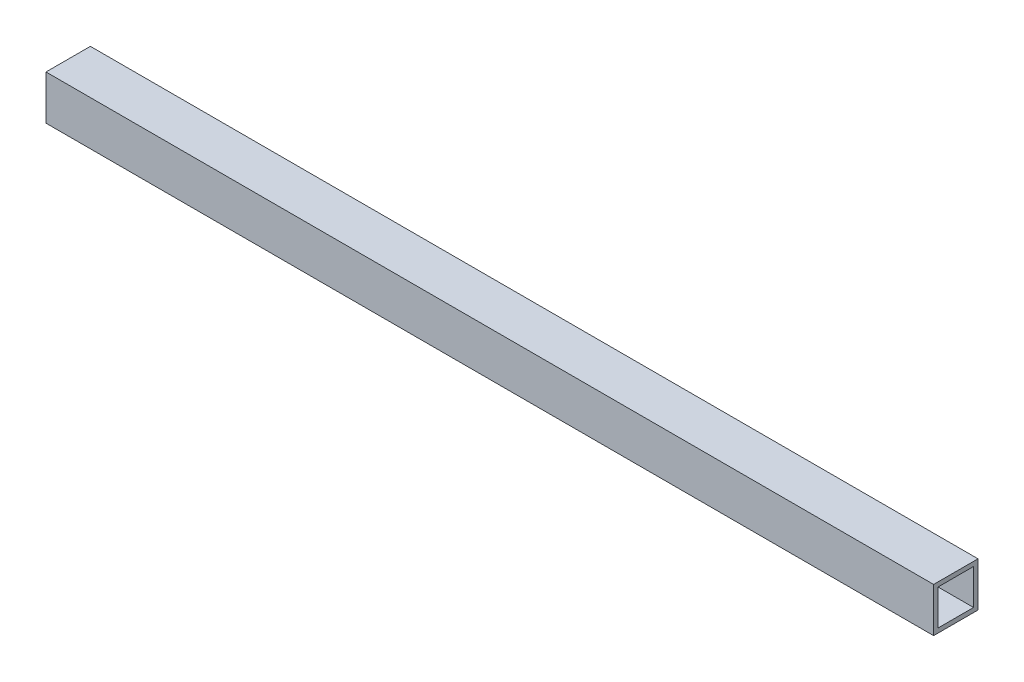
ISO-10303-21;
HEADER;
FILE_DESCRIPTION(('STEP AP214'),'2;1');
FILE_NAME('part.step','',(''),(''),'','','');
FILE_SCHEMA(('AUTOMOTIVE_DESIGN { 1 0 10303 214 1 1 1 1 }'));
ENDSEC;
DATA;
#1=APPLICATION_CONTEXT('core data for automotive mechanical design processes');
#2=APPLICATION_PROTOCOL_DEFINITION('international standard','automotive_design',2000,#1);
#3=PRODUCT_CONTEXT('',#1,'mechanical');
#4=PRODUCT('Part','Part','',(#3));
#5=PRODUCT_RELATED_PRODUCT_CATEGORY('part','',(#4));
#6=PRODUCT_DEFINITION_FORMATION('','',#4);
#7=PRODUCT_DEFINITION_CONTEXT('part definition',#1,'design');
#8=PRODUCT_DEFINITION('design','',#6,#7);
#9=PRODUCT_DEFINITION_SHAPE('','',#8);
#10=(LENGTH_UNIT() NAMED_UNIT(*) SI_UNIT(.MILLI.,.METRE.));
#11=(NAMED_UNIT(*) PLANE_ANGLE_UNIT() SI_UNIT($,.RADIAN.));
#12=(NAMED_UNIT(*) SI_UNIT($,.STERADIAN.) SOLID_ANGLE_UNIT());
#13=UNCERTAINTY_MEASURE_WITH_UNIT(LENGTH_MEASURE(1.E-05),#10,'distance_accuracy_value','');
#14=(GEOMETRIC_REPRESENTATION_CONTEXT(3) GLOBAL_UNCERTAINTY_ASSIGNED_CONTEXT((#13)) GLOBAL_UNIT_ASSIGNED_CONTEXT((#10,
#11,#12)) REPRESENTATION_CONTEXT('',''));
#15=CARTESIAN_POINT('',(0.,0.,0.));
#16=DIRECTION('',(0.,0.,1.));
#17=DIRECTION('',(1.,0.,0.));
#18=AXIS2_PLACEMENT_3D('',#15,#16,#17);
#19=CARTESIAN_POINT('',(300.,0.,0.));
#20=DIRECTION('',(1.,0.,0.));
#21=DIRECTION('',(0.,0.,-1.));
#22=AXIS2_PLACEMENT_3D('',#19,#20,#21);
#23=PLANE('',#22);
#24=DIRECTION('',(0.,1.,0.));
#25=VECTOR('',#24,1.);
#26=CARTESIAN_POINT('',(300.,7.5,-7.5));
#27=LINE('',#26,#25);
#28=CARTESIAN_POINT('',(300.,-7.5,-7.5));
#29=VERTEX_POINT('',#28);
#30=CARTESIAN_POINT('',(300.,7.5,-7.5));
#31=VERTEX_POINT('',#30);
#32=EDGE_CURVE('E133',#29,#31,#27,.T.);
#33=ORIENTED_EDGE('',*,*,#32,.T.);
#34=DIRECTION('',(0.,0.,1.));
#35=VECTOR('',#34,1.);
#36=CARTESIAN_POINT('',(300.,7.5,7.5));
#37=LINE('',#36,#35);
#38=CARTESIAN_POINT('',(300.,7.5,7.5));
#39=VERTEX_POINT('',#38);
#40=EDGE_CURVE('E136',#31,#39,#37,.T.);
#41=ORIENTED_EDGE('',*,*,#40,.T.);
#42=DIRECTION('',(0.,-1.,0.));
#43=VECTOR('',#42,1.);
#44=CARTESIAN_POINT('',(300.,7.5,7.5));
#45=LINE('',#44,#43);
#46=CARTESIAN_POINT('',(300.,-7.5,7.5));
#47=VERTEX_POINT('',#46);
#48=EDGE_CURVE('E139',#39,#47,#45,.T.);
#49=ORIENTED_EDGE('',*,*,#48,.T.);
#50=DIRECTION('',(0.,0.,-1.));
#51=VECTOR('',#50,1.);
#52=CARTESIAN_POINT('',(300.,-7.5,7.5));
#53=LINE('',#52,#51);
#54=EDGE_CURVE('E141',#47,#29,#53,.T.);
#55=ORIENTED_EDGE('',*,*,#54,.T.);
#56=EDGE_LOOP('',(#33,#41,#49,#55));
#57=FACE_BOUND('',#56,.T.);
#58=DIRECTION('',(0.,0.,-1.));
#59=VECTOR('',#58,1.);
#60=CARTESIAN_POINT('',(300.,-6.,6.));
#61=LINE('',#60,#59);
#62=CARTESIAN_POINT('',(300.,-6.,6.));
#63=VERTEX_POINT('',#62);
#64=CARTESIAN_POINT('',(300.,-6.,-6.));
#65=VERTEX_POINT('',#64);
#66=EDGE_CURVE('E105',#63,#65,#61,.T.);
#67=ORIENTED_EDGE('',*,*,#66,.F.);
#68=DIRECTION('',(0.,-1.,0.));
#69=VECTOR('',#68,1.);
#70=CARTESIAN_POINT('',(300.,6.,6.));
#71=LINE('',#70,#69);
#72=CARTESIAN_POINT('',(300.,6.,6.));
#73=VERTEX_POINT('',#72);
#74=EDGE_CURVE('E97',#73,#63,#71,.T.);
#75=ORIENTED_EDGE('',*,*,#74,.F.);
#76=DIRECTION('',(0.,0.,1.));
#77=VECTOR('',#76,1.);
#78=CARTESIAN_POINT('',(300.,6.,6.));
#79=LINE('',#78,#77);
#80=CARTESIAN_POINT('',(300.,6.,-6.));
#81=VERTEX_POINT('',#80);
#82=EDGE_CURVE('E119',#81,#73,#79,.T.);
#83=ORIENTED_EDGE('',*,*,#82,.F.);
#84=DIRECTION('',(0.,1.,0.));
#85=VECTOR('',#84,1.);
#86=CARTESIAN_POINT('',(300.,6.,-6.));
#87=LINE('',#86,#85);
#88=EDGE_CURVE('E117',#65,#81,#87,.T.);
#89=ORIENTED_EDGE('',*,*,#88,.F.);
#90=EDGE_LOOP('',(#67,#75,#83,#89));
#91=FACE_BOUND('',#90,.T.);
#92=ADVANCED_FACE('F32',(#57,#91),#23,.T.);
#93=CARTESIAN_POINT('',(0.,0.,0.));
#94=DIRECTION('',(1.,0.,0.));
#95=DIRECTION('',(0.,0.,-1.));
#96=AXIS2_PLACEMENT_3D('',#93,#94,#95);
#97=PLANE('',#96);
#98=DIRECTION('',(0.,1.,0.));
#99=VECTOR('',#98,1.);
#100=CARTESIAN_POINT('',(0.,7.5,-7.5));
#101=LINE('',#100,#99);
#102=CARTESIAN_POINT('',(0.,-7.5,-7.5));
#103=VERTEX_POINT('',#102);
#104=CARTESIAN_POINT('',(0.,7.5,-7.5));
#105=VERTEX_POINT('',#104);
#106=EDGE_CURVE('E113',#103,#105,#101,.T.);
#107=ORIENTED_EDGE('',*,*,#106,.F.);
#108=DIRECTION('',(0.,0.,-1.));
#109=VECTOR('',#108,1.);
#110=CARTESIAN_POINT('',(0.,-7.5,7.5));
#111=LINE('',#110,#109);
#112=CARTESIAN_POINT('',(0.,-7.5,7.5));
#113=VERTEX_POINT('',#112);
#114=EDGE_CURVE('E137',#113,#103,#111,.T.);
#115=ORIENTED_EDGE('',*,*,#114,.F.);
#116=DIRECTION('',(0.,-1.,0.));
#117=VECTOR('',#116,1.);
#118=CARTESIAN_POINT('',(0.,7.5,7.5));
#119=LINE('',#118,#117);
#120=CARTESIAN_POINT('',(0.,7.5,7.5));
#121=VERTEX_POINT('',#120);
#122=EDGE_CURVE('E148',#121,#113,#119,.T.);
#123=ORIENTED_EDGE('',*,*,#122,.F.);
#124=DIRECTION('',(0.,0.,1.));
#125=VECTOR('',#124,1.);
#126=CARTESIAN_POINT('',(0.,7.5,7.5));
#127=LINE('',#126,#125);
#128=EDGE_CURVE('E146',#105,#121,#127,.T.);
#129=ORIENTED_EDGE('',*,*,#128,.F.);
#130=EDGE_LOOP('',(#107,#115,#123,#129));
#131=FACE_BOUND('',#130,.T.);
#132=DIRECTION('',(0.,-1.,0.));
#133=VECTOR('',#132,1.);
#134=CARTESIAN_POINT('',(0.,6.,6.));
#135=LINE('',#134,#133);
#136=CARTESIAN_POINT('',(0.,6.,6.));
#137=VERTEX_POINT('',#136);
#138=CARTESIAN_POINT('',(0.,-6.,6.));
#139=VERTEX_POINT('',#138);
#140=EDGE_CURVE('E55',#137,#139,#135,.T.);
#141=ORIENTED_EDGE('',*,*,#140,.T.);
#142=DIRECTION('',(0.,0.,-1.));
#143=VECTOR('',#142,1.);
#144=CARTESIAN_POINT('',(0.,-6.,6.));
#145=LINE('',#144,#143);
#146=CARTESIAN_POINT('',(0.,-6.,-6.));
#147=VERTEX_POINT('',#146);
#148=EDGE_CURVE('E112',#139,#147,#145,.T.);
#149=ORIENTED_EDGE('',*,*,#148,.T.);
#150=DIRECTION('',(0.,1.,0.));
#151=VECTOR('',#150,1.);
#152=CARTESIAN_POINT('',(0.,6.,-6.));
#153=LINE('',#152,#151);
#154=CARTESIAN_POINT('',(0.,6.,-6.));
#155=VERTEX_POINT('',#154);
#156=EDGE_CURVE('E125',#147,#155,#153,.T.);
#157=ORIENTED_EDGE('',*,*,#156,.T.);
#158=DIRECTION('',(0.,0.,1.));
#159=VECTOR('',#158,1.);
#160=CARTESIAN_POINT('',(0.,6.,6.));
#161=LINE('',#160,#159);
#162=EDGE_CURVE('E106',#155,#137,#161,.T.);
#163=ORIENTED_EDGE('',*,*,#162,.T.);
#164=EDGE_LOOP('',(#141,#149,#157,#163));
#165=FACE_BOUND('',#164,.T.);
#166=ADVANCED_FACE('F166',(#131,#165),#97,.F.);
#167=CARTESIAN_POINT('',(300.,7.5,-7.5));
#168=DIRECTION('',(0.,0.,1.));
#169=DIRECTION('',(0.,-1.,0.));
#170=AXIS2_PLACEMENT_3D('',#167,#168,#169);
#171=PLANE('',#170);
#172=ORIENTED_EDGE('',*,*,#106,.T.);
#173=DIRECTION('',(-1.,0.,0.));
#174=VECTOR('',#173,1.);
#175=CARTESIAN_POINT('',(300.,7.5,-7.5));
#176=LINE('',#175,#174);
#177=EDGE_CURVE('E11',#31,#105,#176,.T.);
#178=ORIENTED_EDGE('',*,*,#177,.F.);
#179=ORIENTED_EDGE('',*,*,#32,.F.);
#180=DIRECTION('',(-1.,0.,0.));
#181=VECTOR('',#180,1.);
#182=CARTESIAN_POINT('',(300.,-7.5,-7.5));
#183=LINE('',#182,#181);
#184=EDGE_CURVE('E143',#29,#103,#183,.T.);
#185=ORIENTED_EDGE('',*,*,#184,.T.);
#186=EDGE_LOOP('',(#172,#178,#179,#185));
#187=FACE_BOUND('',#186,.T.);
#188=ADVANCED_FACE('F34',(#187),#171,.F.);
#189=CARTESIAN_POINT('',(300.,7.5,7.5));
#190=DIRECTION('',(0.,-1.,0.));
#191=DIRECTION('',(0.,0.,-1.));
#192=AXIS2_PLACEMENT_3D('',#189,#190,#191);
#193=PLANE('',#192);
#194=ORIENTED_EDGE('',*,*,#128,.T.);
#195=DIRECTION('',(-1.,0.,0.));
#196=VECTOR('',#195,1.);
#197=CARTESIAN_POINT('',(300.,7.5,7.5));
#198=LINE('',#197,#196);
#199=EDGE_CURVE('E40',#39,#121,#198,.T.);
#200=ORIENTED_EDGE('',*,*,#199,.F.);
#201=ORIENTED_EDGE('',*,*,#40,.F.);
#202=ORIENTED_EDGE('',*,*,#177,.T.);
#203=EDGE_LOOP('',(#194,#200,#201,#202));
#204=FACE_BOUND('',#203,.T.);
#205=ADVANCED_FACE('F176',(#204),#193,.F.);
#206=CARTESIAN_POINT('',(300.,7.5,7.5));
#207=DIRECTION('',(0.,0.,-1.));
#208=DIRECTION('',(0.,1.,0.));
#209=AXIS2_PLACEMENT_3D('',#206,#207,#208);
#210=PLANE('',#209);
#211=ORIENTED_EDGE('',*,*,#122,.T.);
#212=DIRECTION('',(-1.,0.,0.));
#213=VECTOR('',#212,1.);
#214=CARTESIAN_POINT('',(300.,-7.5,7.5));
#215=LINE('',#214,#213);
#216=EDGE_CURVE('E153',#47,#113,#215,.T.);
#217=ORIENTED_EDGE('',*,*,#216,.F.);
#218=ORIENTED_EDGE('',*,*,#48,.F.);
#219=ORIENTED_EDGE('',*,*,#199,.T.);
#220=EDGE_LOOP('',(#211,#217,#218,#219));
#221=FACE_BOUND('',#220,.T.);
#222=ADVANCED_FACE('F160',(#221),#210,.F.);
#223=CARTESIAN_POINT('',(300.,-7.5,7.5));
#224=DIRECTION('',(0.,1.,0.));
#225=DIRECTION('',(0.,0.,1.));
#226=AXIS2_PLACEMENT_3D('',#223,#224,#225);
#227=PLANE('',#226);
#228=ORIENTED_EDGE('',*,*,#114,.T.);
#229=ORIENTED_EDGE('',*,*,#184,.F.);
#230=ORIENTED_EDGE('',*,*,#54,.F.);
#231=ORIENTED_EDGE('',*,*,#216,.T.);
#232=EDGE_LOOP('',(#228,#229,#230,#231));
#233=FACE_BOUND('',#232,.T.);
#234=ADVANCED_FACE('F170',(#233),#227,.F.);
#235=CARTESIAN_POINT('',(300.,6.,6.));
#236=DIRECTION('',(0.,0.,-1.));
#237=DIRECTION('',(0.,1.,0.));
#238=AXIS2_PLACEMENT_3D('',#235,#236,#237);
#239=PLANE('',#238);
#240=ORIENTED_EDGE('',*,*,#140,.F.);
#241=DIRECTION('',(-1.,0.,0.));
#242=VECTOR('',#241,1.);
#243=CARTESIAN_POINT('',(300.,6.,6.));
#244=LINE('',#243,#242);
#245=EDGE_CURVE('E101',#73,#137,#244,.T.);
#246=ORIENTED_EDGE('',*,*,#245,.F.);
#247=ORIENTED_EDGE('',*,*,#74,.T.);
#248=DIRECTION('',(-1.,0.,0.));
#249=VECTOR('',#248,1.);
#250=CARTESIAN_POINT('',(300.,-6.,6.));
#251=LINE('',#250,#249);
#252=EDGE_CURVE('E100',#63,#139,#251,.T.);
#253=ORIENTED_EDGE('',*,*,#252,.T.);
#254=EDGE_LOOP('',(#240,#246,#247,#253));
#255=FACE_BOUND('',#254,.T.);
#256=ADVANCED_FACE('F99',(#255),#239,.T.);
#257=CARTESIAN_POINT('',(300.,-6.,6.));
#258=DIRECTION('',(0.,1.,0.));
#259=DIRECTION('',(0.,0.,1.));
#260=AXIS2_PLACEMENT_3D('',#257,#258,#259);
#261=PLANE('',#260);
#262=ORIENTED_EDGE('',*,*,#148,.F.);
#263=ORIENTED_EDGE('',*,*,#252,.F.);
#264=ORIENTED_EDGE('',*,*,#66,.T.);
#265=DIRECTION('',(-1.,0.,0.));
#266=VECTOR('',#265,1.);
#267=CARTESIAN_POINT('',(300.,-6.,-6.));
#268=LINE('',#267,#266);
#269=EDGE_CURVE('E114',#65,#147,#268,.T.);
#270=ORIENTED_EDGE('',*,*,#269,.T.);
#271=EDGE_LOOP('',(#262,#263,#264,#270));
#272=FACE_BOUND('',#271,.T.);
#273=ADVANCED_FACE('F109',(#272),#261,.T.);
#274=CARTESIAN_POINT('',(300.,6.,-6.));
#275=DIRECTION('',(0.,0.,1.));
#276=DIRECTION('',(0.,-1.,0.));
#277=AXIS2_PLACEMENT_3D('',#274,#275,#276);
#278=PLANE('',#277);
#279=ORIENTED_EDGE('',*,*,#156,.F.);
#280=ORIENTED_EDGE('',*,*,#269,.F.);
#281=ORIENTED_EDGE('',*,*,#88,.T.);
#282=DIRECTION('',(-1.,0.,0.));
#283=VECTOR('',#282,1.);
#284=CARTESIAN_POINT('',(300.,6.,-6.));
#285=LINE('',#284,#283);
#286=EDGE_CURVE('E47',#81,#155,#285,.T.);
#287=ORIENTED_EDGE('',*,*,#286,.T.);
#288=EDGE_LOOP('',(#279,#280,#281,#287));
#289=FACE_BOUND('',#288,.T.);
#290=ADVANCED_FACE('F199',(#289),#278,.T.);
#291=CARTESIAN_POINT('',(300.,6.,6.));
#292=DIRECTION('',(0.,-1.,0.));
#293=DIRECTION('',(0.,0.,-1.));
#294=AXIS2_PLACEMENT_3D('',#291,#292,#293);
#295=PLANE('',#294);
#296=ORIENTED_EDGE('',*,*,#162,.F.);
#297=ORIENTED_EDGE('',*,*,#286,.F.);
#298=ORIENTED_EDGE('',*,*,#82,.T.);
#299=ORIENTED_EDGE('',*,*,#245,.T.);
#300=EDGE_LOOP('',(#296,#297,#298,#299));
#301=FACE_BOUND('',#300,.T.);
#302=ADVANCED_FACE('F203',(#301),#295,.T.);
#303=CLOSED_SHELL('',(#92,#166,#188,#205,#222,#234,#256,#273,#290,#302));
#304=MANIFOLD_SOLID_BREP('B2',#303);
#305=ADVANCED_BREP_SHAPE_REPRESENTATION('',(#18,#304),#14);
#306=SHAPE_DEFINITION_REPRESENTATION(#9,#305);
ENDSEC;
END-ISO-10303-21;
